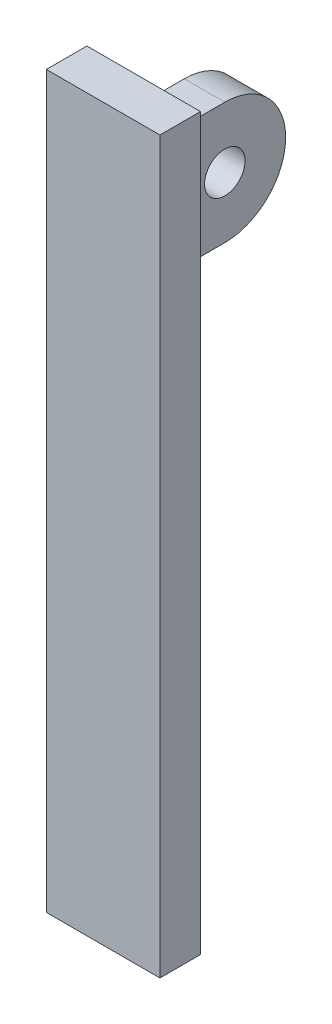
ISO-10303-21;
HEADER;
FILE_DESCRIPTION(('STEP AP214'),'2;1');
FILE_NAME('part.step','',(''),(''),'','','');
FILE_SCHEMA(('AUTOMOTIVE_DESIGN { 1 0 10303 214 1 1 1 1 }'));
ENDSEC;
DATA;
#1=APPLICATION_CONTEXT('core data for automotive mechanical design processes');
#2=APPLICATION_PROTOCOL_DEFINITION('international standard','automotive_design',2000,#1);
#3=PRODUCT_CONTEXT('',#1,'mechanical');
#4=PRODUCT('Part','Part','',(#3));
#5=PRODUCT_RELATED_PRODUCT_CATEGORY('part','',(#4));
#6=PRODUCT_DEFINITION_FORMATION('','',#4);
#7=PRODUCT_DEFINITION_CONTEXT('part definition',#1,'design');
#8=PRODUCT_DEFINITION('design','',#6,#7);
#9=PRODUCT_DEFINITION_SHAPE('','',#8);
#10=(LENGTH_UNIT() NAMED_UNIT(*) SI_UNIT(.MILLI.,.METRE.));
#11=(NAMED_UNIT(*) PLANE_ANGLE_UNIT() SI_UNIT($,.RADIAN.));
#12=(NAMED_UNIT(*) SI_UNIT($,.STERADIAN.) SOLID_ANGLE_UNIT());
#13=UNCERTAINTY_MEASURE_WITH_UNIT(LENGTH_MEASURE(1.E-05),#10,'distance_accuracy_value','');
#14=(GEOMETRIC_REPRESENTATION_CONTEXT(3) GLOBAL_UNCERTAINTY_ASSIGNED_CONTEXT((#13)) GLOBAL_UNIT_ASSIGNED_CONTEXT((#10,
#11,#12)) REPRESENTATION_CONTEXT('',''));
#15=CARTESIAN_POINT('',(0.,0.,0.));
#16=DIRECTION('',(0.,0.,1.));
#17=DIRECTION('',(1.,0.,0.));
#18=AXIS2_PLACEMENT_3D('',#15,#16,#17);
#19=CARTESIAN_POINT('',(-14.,270.,-5.));
#20=DIRECTION('',(0.,0.,1.));
#21=DIRECTION('',(1.,0.,0.));
#22=AXIS2_PLACEMENT_3D('',#19,#20,#21);
#23=PLANE('',#22);
#24=DIRECTION('',(0.,-1.,0.));
#25=VECTOR('',#24,1.);
#26=CARTESIAN_POINT('',(-14.,270.,-5.));
#27=LINE('',#26,#25);
#28=CARTESIAN_POINT('',(-14.,180.,-5.));
#29=VERTEX_POINT('',#28);
#30=CARTESIAN_POINT('',(-14.,0.,-5.));
#31=VERTEX_POINT('',#30);
#32=EDGE_CURVE('E56',#29,#31,#27,.T.);
#33=ORIENTED_EDGE('',*,*,#32,.F.);
#34=DIRECTION('',(-1.,0.,0.));
#35=VECTOR('',#34,1.);
#36=CARTESIAN_POINT('',(14.,180.,-5.));
#37=LINE('',#36,#35);
#38=CARTESIAN_POINT('',(14.,180.,-5.));
#39=VERTEX_POINT('',#38);
#40=EDGE_CURVE('E118',#39,#29,#37,.T.);
#41=ORIENTED_EDGE('',*,*,#40,.F.);
#42=DIRECTION('',(0.,-1.,0.));
#43=VECTOR('',#42,1.);
#44=CARTESIAN_POINT('',(14.,270.,-5.));
#45=LINE('',#44,#43);
#46=CARTESIAN_POINT('',(14.,0.,-5.));
#47=VERTEX_POINT('',#46);
#48=EDGE_CURVE('E13',#39,#47,#45,.T.);
#49=ORIENTED_EDGE('',*,*,#48,.T.);
#50=DIRECTION('',(-1.,0.,0.));
#51=VECTOR('',#50,1.);
#52=CARTESIAN_POINT('',(-14.,0.,-5.));
#53=LINE('',#52,#51);
#54=EDGE_CURVE('E144',#47,#31,#53,.T.);
#55=ORIENTED_EDGE('',*,*,#54,.T.);
#56=EDGE_LOOP('',(#33,#41,#49,#55));
#57=FACE_BOUND('',#56,.T.);
#58=DIRECTION('',(0.,-1.,0.));
#59=VECTOR('',#58,1.);
#60=CARTESIAN_POINT('',(5.00000000000006,170.,-5.));
#61=LINE('',#60,#59);
#62=CARTESIAN_POINT('',(5.00000000000006,170.,-5.));
#63=VERTEX_POINT('',#62);
#64=CARTESIAN_POINT('',(5.00000000000005,140.,-5.));
#65=VERTEX_POINT('',#64);
#66=EDGE_CURVE('E169',#63,#65,#61,.T.);
#67=ORIENTED_EDGE('',*,*,#66,.F.);
#68=DIRECTION('',(1.,0.,0.));
#69=VECTOR('',#68,1.);
#70=CARTESIAN_POINT('',(-4.99999999999994,170.,-5.));
#71=LINE('',#70,#69);
#72=CARTESIAN_POINT('',(-4.99999999999994,170.,-5.));
#73=VERTEX_POINT('',#72);
#74=EDGE_CURVE('E160',#73,#63,#71,.T.);
#75=ORIENTED_EDGE('',*,*,#74,.F.);
#76=DIRECTION('',(0.,1.,0.));
#77=VECTOR('',#76,1.);
#78=CARTESIAN_POINT('',(-4.99999999999994,170.,-5.));
#79=LINE('',#78,#77);
#80=CARTESIAN_POINT('',(-4.99999999999995,140.,-5.));
#81=VERTEX_POINT('',#80);
#82=EDGE_CURVE('E163',#81,#73,#79,.T.);
#83=ORIENTED_EDGE('',*,*,#82,.F.);
#84=DIRECTION('',(-1.,0.,0.));
#85=VECTOR('',#84,1.);
#86=CARTESIAN_POINT('',(-4.99999999999995,140.,-5.));
#87=LINE('',#86,#85);
#88=EDGE_CURVE('E166',#65,#81,#87,.T.);
#89=ORIENTED_EDGE('',*,*,#88,.F.);
#90=EDGE_LOOP('',(#67,#75,#83,#89));
#91=FACE_BOUND('',#90,.T.);
#92=ADVANCED_FACE('F48',(#57,#91),#23,.F.);
#93=CARTESIAN_POINT('',(14.,270.,5.));
#94=DIRECTION('',(-1.,0.,0.));
#95=DIRECTION('',(0.,0.,1.));
#96=AXIS2_PLACEMENT_3D('',#93,#94,#95);
#97=PLANE('',#96);
#98=ORIENTED_EDGE('',*,*,#48,.F.);
#99=DIRECTION('',(0.,0.,-1.));
#100=VECTOR('',#99,1.);
#101=CARTESIAN_POINT('',(14.,180.,5.));
#102=LINE('',#101,#100);
#103=CARTESIAN_POINT('',(14.,180.,5.));
#104=VERTEX_POINT('',#103);
#105=EDGE_CURVE('E113',#104,#39,#102,.T.);
#106=ORIENTED_EDGE('',*,*,#105,.F.);
#107=DIRECTION('',(0.,-1.,0.));
#108=VECTOR('',#107,1.);
#109=CARTESIAN_POINT('',(14.,270.,5.));
#110=LINE('',#109,#108);
#111=CARTESIAN_POINT('',(14.,0.,5.));
#112=VERTEX_POINT('',#111);
#113=EDGE_CURVE('E123',#104,#112,#110,.T.);
#114=ORIENTED_EDGE('',*,*,#113,.T.);
#115=DIRECTION('',(0.,0.,-1.));
#116=VECTOR('',#115,1.);
#117=CARTESIAN_POINT('',(14.,0.,5.));
#118=LINE('',#117,#116);
#119=EDGE_CURVE('E147',#112,#47,#118,.T.);
#120=ORIENTED_EDGE('',*,*,#119,.T.);
#121=EDGE_LOOP('',(#98,#106,#114,#120));
#122=FACE_BOUND('',#121,.T.);
#123=ADVANCED_FACE('F50',(#122),#97,.F.);
#124=CARTESIAN_POINT('',(-14.,270.,5.));
#125=DIRECTION('',(1.,0.,0.));
#126=DIRECTION('',(0.,0.,-1.));
#127=AXIS2_PLACEMENT_3D('',#124,#125,#126);
#128=PLANE('',#127);
#129=DIRECTION('',(0.,-1.,0.));
#130=VECTOR('',#129,1.);
#131=CARTESIAN_POINT('',(-14.,270.,5.));
#132=LINE('',#131,#130);
#133=CARTESIAN_POINT('',(-14.,180.,5.));
#134=VERTEX_POINT('',#133);
#135=CARTESIAN_POINT('',(-14.,0.,5.));
#136=VERTEX_POINT('',#135);
#137=EDGE_CURVE('E130',#134,#136,#132,.T.);
#138=ORIENTED_EDGE('',*,*,#137,.F.);
#139=DIRECTION('',(0.,0.,-1.));
#140=VECTOR('',#139,1.);
#141=CARTESIAN_POINT('',(-14.,180.,5.));
#142=LINE('',#141,#140);
#143=EDGE_CURVE('E63',#134,#29,#142,.T.);
#144=ORIENTED_EDGE('',*,*,#143,.T.);
#145=ORIENTED_EDGE('',*,*,#32,.T.);
#146=DIRECTION('',(0.,0.,1.));
#147=VECTOR('',#146,1.);
#148=CARTESIAN_POINT('',(-14.,0.,5.));
#149=LINE('',#148,#147);
#150=EDGE_CURVE('E133',#31,#136,#149,.T.);
#151=ORIENTED_EDGE('',*,*,#150,.T.);
#152=EDGE_LOOP('',(#138,#144,#145,#151));
#153=FACE_BOUND('',#152,.T.);
#154=ADVANCED_FACE('F140',(#153),#128,.F.);
#155=CARTESIAN_POINT('',(-14.,270.,5.));
#156=DIRECTION('',(0.,0.,-1.));
#157=DIRECTION('',(-1.,0.,0.));
#158=AXIS2_PLACEMENT_3D('',#155,#156,#157);
#159=PLANE('',#158);
#160=ORIENTED_EDGE('',*,*,#113,.F.);
#161=DIRECTION('',(-1.,0.,0.));
#162=VECTOR('',#161,1.);
#163=CARTESIAN_POINT('',(14.,180.,5.));
#164=LINE('',#163,#162);
#165=EDGE_CURVE('E110',#104,#134,#164,.T.);
#166=ORIENTED_EDGE('',*,*,#165,.T.);
#167=ORIENTED_EDGE('',*,*,#137,.T.);
#168=DIRECTION('',(1.,0.,0.));
#169=VECTOR('',#168,1.);
#170=CARTESIAN_POINT('',(-14.,0.,5.));
#171=LINE('',#170,#169);
#172=EDGE_CURVE('E128',#136,#112,#171,.T.);
#173=ORIENTED_EDGE('',*,*,#172,.T.);
#174=EDGE_LOOP('',(#160,#166,#167,#173));
#175=FACE_BOUND('',#174,.T.);
#176=ADVANCED_FACE('F126',(#175),#159,.F.);
#177=CARTESIAN_POINT('',(0.,0.,0.));
#178=DIRECTION('',(0.,-1.,0.));
#179=DIRECTION('',(0.,0.,-1.));
#180=AXIS2_PLACEMENT_3D('',#177,#178,#179);
#181=PLANE('',#180);
#182=ORIENTED_EDGE('',*,*,#119,.F.);
#183=ORIENTED_EDGE('',*,*,#172,.F.);
#184=ORIENTED_EDGE('',*,*,#150,.F.);
#185=ORIENTED_EDGE('',*,*,#54,.F.);
#186=EDGE_LOOP('',(#182,#183,#184,#185));
#187=FACE_BOUND('',#186,.T.);
#188=ADVANCED_FACE('F149',(#187),#181,.T.);
#189=CARTESIAN_POINT('',(5.00000000000006,170.,-35.));
#190=DIRECTION('',(-1.,0.,0.));
#191=DIRECTION('',(0.,-1.,0.));
#192=AXIS2_PLACEMENT_3D('',#189,#190,#191);
#193=PLANE('',#192);
#194=CARTESIAN_POINT('',(5.00000000000005,155.,-20.));
#195=DIRECTION('',(-1.,0.,0.));
#196=DIRECTION('',(0.,-1.,0.));
#197=AXIS2_PLACEMENT_3D('',#194,#195,#196);
#198=CIRCLE('',#197,5.);
#199=CARTESIAN_POINT('',(5.00000000000005,150.,-20.));
#200=VERTEX_POINT('',#199);
#201=EDGE_CURVE('E172',#200,#200,#198,.T.);
#202=ORIENTED_EDGE('',*,*,#201,.T.);
#203=EDGE_LOOP('',(#202));
#204=FACE_BOUND('',#203,.T.);
#205=DIRECTION('',(0.,0.,1.));
#206=VECTOR('',#205,1.);
#207=CARTESIAN_POINT('',(5.00000000000005,140.,-35.));
#208=LINE('',#207,#206);
#209=CARTESIAN_POINT('',(5.00000000000005,140.,-20.));
#210=VERTEX_POINT('',#209);
#211=EDGE_CURVE('E152',#210,#65,#208,.T.);
#212=ORIENTED_EDGE('',*,*,#211,.F.);
#213=CARTESIAN_POINT('',(5.00000000000005,155.,-20.));
#214=DIRECTION('',(-1.,0.,0.));
#215=DIRECTION('',(0.,-1.,0.));
#216=AXIS2_PLACEMENT_3D('',#213,#214,#215);
#217=CIRCLE('',#216,15.);
#218=CARTESIAN_POINT('',(5.00000000000005,170.,-20.));
#219=VERTEX_POINT('',#218);
#220=EDGE_CURVE('E178',#210,#219,#217,.F.);
#221=ORIENTED_EDGE('',*,*,#220,.T.);
#222=DIRECTION('',(0.,0.,1.));
#223=VECTOR('',#222,1.);
#224=CARTESIAN_POINT('',(5.00000000000006,170.,-35.));
#225=LINE('',#224,#223);
#226=EDGE_CURVE('E158',#219,#63,#225,.T.);
#227=ORIENTED_EDGE('',*,*,#226,.T.);
#228=ORIENTED_EDGE('',*,*,#66,.T.);
#229=EDGE_LOOP('',(#212,#221,#227,#228));
#230=FACE_BOUND('',#229,.T.);
#231=ADVANCED_FACE('F203',(#204,#230),#193,.F.);
#232=CARTESIAN_POINT('',(-4.99999999999995,140.,-35.));
#233=DIRECTION('',(0.,1.,0.));
#234=DIRECTION('',(0.,0.,1.));
#235=AXIS2_PLACEMENT_3D('',#232,#233,#234);
#236=PLANE('',#235);
#237=DIRECTION('',(0.,0.,1.));
#238=VECTOR('',#237,1.);
#239=CARTESIAN_POINT('',(-4.99999999999995,140.,-35.));
#240=LINE('',#239,#238);
#241=CARTESIAN_POINT('',(-4.99999999999995,140.,-20.));
#242=VERTEX_POINT('',#241);
#243=EDGE_CURVE('E154',#242,#81,#240,.T.);
#244=ORIENTED_EDGE('',*,*,#243,.F.);
#245=DIRECTION('',(-1.,0.,0.));
#246=VECTOR('',#245,1.);
#247=CARTESIAN_POINT('',(25.,140.,-20.));
#248=LINE('',#247,#246);
#249=EDGE_CURVE('E180',#210,#242,#248,.T.);
#250=ORIENTED_EDGE('',*,*,#249,.F.);
#251=ORIENTED_EDGE('',*,*,#211,.T.);
#252=ORIENTED_EDGE('',*,*,#88,.T.);
#253=EDGE_LOOP('',(#244,#250,#251,#252));
#254=FACE_BOUND('',#253,.T.);
#255=ADVANCED_FACE('F191',(#254),#236,.F.);
#256=CARTESIAN_POINT('',(-4.99999999999994,170.,-35.));
#257=DIRECTION('',(1.,0.,0.));
#258=DIRECTION('',(0.,1.,0.));
#259=AXIS2_PLACEMENT_3D('',#256,#257,#258);
#260=PLANE('',#259);
#261=CARTESIAN_POINT('',(-4.99999999999995,155.,-20.));
#262=DIRECTION('',(-1.,0.,0.));
#263=DIRECTION('',(0.,-1.,0.));
#264=AXIS2_PLACEMENT_3D('',#261,#262,#263);
#265=CIRCLE('',#264,5.);
#266=CARTESIAN_POINT('',(-4.99999999999995,150.,-20.));
#267=VERTEX_POINT('',#266);
#268=EDGE_CURVE('E175',#267,#267,#265,.T.);
#269=ORIENTED_EDGE('',*,*,#268,.F.);
#270=EDGE_LOOP('',(#269));
#271=FACE_BOUND('',#270,.T.);
#272=DIRECTION('',(0.,0.,1.));
#273=VECTOR('',#272,1.);
#274=CARTESIAN_POINT('',(-4.99999999999994,170.,-35.));
#275=LINE('',#274,#273);
#276=CARTESIAN_POINT('',(-4.99999999999994,170.,-20.));
#277=VERTEX_POINT('',#276);
#278=EDGE_CURVE('E156',#277,#73,#275,.T.);
#279=ORIENTED_EDGE('',*,*,#278,.F.);
#280=CARTESIAN_POINT('',(-4.99999999999995,155.,-20.));
#281=DIRECTION('',(1.,0.,0.));
#282=DIRECTION('',(0.,-1.,0.));
#283=AXIS2_PLACEMENT_3D('',#280,#281,#282);
#284=CIRCLE('',#283,15.);
#285=EDGE_CURVE('E71',#242,#277,#284,.T.);
#286=ORIENTED_EDGE('',*,*,#285,.F.);
#287=ORIENTED_EDGE('',*,*,#243,.T.);
#288=ORIENTED_EDGE('',*,*,#82,.T.);
#289=EDGE_LOOP('',(#279,#286,#287,#288));
#290=FACE_BOUND('',#289,.T.);
#291=ADVANCED_FACE('F196',(#271,#290),#260,.F.);
#292=CARTESIAN_POINT('',(-4.99999999999994,170.,-35.));
#293=DIRECTION('',(0.,-1.,0.));
#294=DIRECTION('',(0.,0.,-1.));
#295=AXIS2_PLACEMENT_3D('',#292,#293,#294);
#296=PLANE('',#295);
#297=ORIENTED_EDGE('',*,*,#226,.F.);
#298=DIRECTION('',(-1.,0.,0.));
#299=VECTOR('',#298,1.);
#300=CARTESIAN_POINT('',(25.0000000000001,170.,-20.));
#301=LINE('',#300,#299);
#302=EDGE_CURVE('E181',#219,#277,#301,.T.);
#303=ORIENTED_EDGE('',*,*,#302,.T.);
#304=ORIENTED_EDGE('',*,*,#278,.T.);
#305=ORIENTED_EDGE('',*,*,#74,.T.);
#306=EDGE_LOOP('',(#297,#303,#304,#305));
#307=FACE_BOUND('',#306,.T.);
#308=ADVANCED_FACE('F201',(#307),#296,.F.);
#309=CARTESIAN_POINT('',(25.,155.,-20.));
#310=DIRECTION('',(-1.,0.,0.));
#311=DIRECTION('',(0.,-1.,0.));
#312=AXIS2_PLACEMENT_3D('',#309,#310,#311);
#313=CYLINDRICAL_SURFACE('',#312,5.);
#314=ORIENTED_EDGE('',*,*,#268,.T.);
#315=EDGE_LOOP('',(#314));
#316=FACE_BOUND('',#315,.T.);
#317=ORIENTED_EDGE('',*,*,#201,.F.);
#318=EDGE_LOOP('',(#317));
#319=FACE_BOUND('',#318,.T.);
#320=ADVANCED_FACE('F259',(#316,#319),#313,.F.);
#321=CARTESIAN_POINT('',(25.,155.,-20.));
#322=DIRECTION('',(-1.,0.,0.));
#323=DIRECTION('',(0.,-1.,0.));
#324=AXIS2_PLACEMENT_3D('',#321,#322,#323);
#325=CYLINDRICAL_SURFACE('',#324,15.);
#326=ORIENTED_EDGE('',*,*,#249,.T.);
#327=ORIENTED_EDGE('',*,*,#285,.T.);
#328=ORIENTED_EDGE('',*,*,#302,.F.);
#329=ORIENTED_EDGE('',*,*,#220,.F.);
#330=EDGE_LOOP('',(#326,#327,#328,#329));
#331=FACE_BOUND('',#330,.T.);
#332=ADVANCED_FACE('F188',(#331),#325,.T.);
#333=CARTESIAN_POINT('',(14.,180.,5.));
#334=DIRECTION('',(0.,-1.,0.));
#335=DIRECTION('',(0.,0.,-1.));
#336=AXIS2_PLACEMENT_3D('',#333,#334,#335);
#337=PLANE('',#336);
#338=ORIENTED_EDGE('',*,*,#40,.T.);
#339=ORIENTED_EDGE('',*,*,#143,.F.);
#340=ORIENTED_EDGE('',*,*,#165,.F.);
#341=ORIENTED_EDGE('',*,*,#105,.T.);
#342=EDGE_LOOP('',(#338,#339,#340,#341));
#343=FACE_BOUND('',#342,.T.);
#344=ADVANCED_FACE('F112',(#343),#337,.F.);
#345=CLOSED_SHELL('',(#92,#123,#154,#176,#188,#231,#255,#291,#308,#320,#332,#344));
#346=MANIFOLD_SOLID_BREP('B2',#345);
#347=ADVANCED_BREP_SHAPE_REPRESENTATION('',(#18,#346),#14);
#348=SHAPE_DEFINITION_REPRESENTATION(#9,#347);
ENDSEC;
END-ISO-10303-21;
